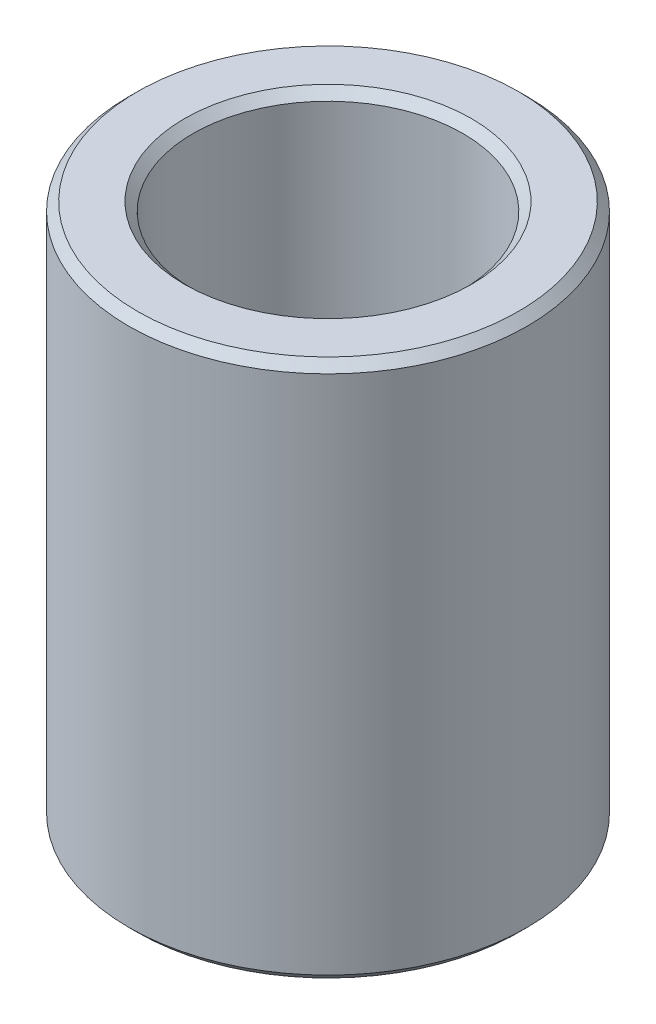
ISO-10303-21;
HEADER;
FILE_DESCRIPTION(('STEP AP214'),'2;1');
FILE_NAME('part.step','',(''),(''),'','','');
FILE_SCHEMA(('AUTOMOTIVE_DESIGN { 1 0 10303 214 1 1 1 1 }'));
ENDSEC;
DATA;
#1=APPLICATION_CONTEXT('core data for automotive mechanical design processes');
#2=APPLICATION_PROTOCOL_DEFINITION('international standard','automotive_design',2000,#1);
#3=PRODUCT_CONTEXT('',#1,'mechanical');
#4=PRODUCT('Part','Part','',(#3));
#5=PRODUCT_RELATED_PRODUCT_CATEGORY('part','',(#4));
#6=PRODUCT_DEFINITION_FORMATION('','',#4);
#7=PRODUCT_DEFINITION_CONTEXT('part definition',#1,'design');
#8=PRODUCT_DEFINITION('design','',#6,#7);
#9=PRODUCT_DEFINITION_SHAPE('','',#8);
#10=(LENGTH_UNIT() NAMED_UNIT(*) SI_UNIT(.MILLI.,.METRE.));
#11=(NAMED_UNIT(*) PLANE_ANGLE_UNIT() SI_UNIT($,.RADIAN.));
#12=(NAMED_UNIT(*) SI_UNIT($,.STERADIAN.) SOLID_ANGLE_UNIT());
#13=UNCERTAINTY_MEASURE_WITH_UNIT(LENGTH_MEASURE(1.E-05),#10,'distance_accuracy_value','');
#14=(GEOMETRIC_REPRESENTATION_CONTEXT(3) GLOBAL_UNCERTAINTY_ASSIGNED_CONTEXT((#13)) GLOBAL_UNIT_ASSIGNED_CONTEXT((#10,
#11,#12)) REPRESENTATION_CONTEXT('',''));
#15=CARTESIAN_POINT('',(0.,0.,0.));
#16=DIRECTION('',(0.,0.,1.));
#17=DIRECTION('',(1.,0.,0.));
#18=AXIS2_PLACEMENT_3D('',#15,#16,#17);
#19=CARTESIAN_POINT('',(0.,162.129846578143,0.));
#20=DIRECTION('',(0.,-1.,0.));
#21=DIRECTION('',(0.,0.,-1.));
#22=AXIS2_PLACEMENT_3D('',#19,#20,#21);
#23=CYLINDRICAL_SURFACE('',#22,60.);
#24=CARTESIAN_POINT('',(0.,2.5911518404744,0.));
#25=DIRECTION('',(0.,1.,0.));
#26=DIRECTION('',(0.,0.,1.));
#27=AXIS2_PLACEMENT_3D('',#24,#25,#26);
#28=CIRCLE('',#27,60.);
#29=CARTESIAN_POINT('',(0.,2.5911518404744,60.));
#30=VERTEX_POINT('',#29);
#31=EDGE_CURVE('E10',#30,#30,#28,.T.);
#32=ORIENTED_EDGE('',*,*,#31,.T.);
#33=EDGE_LOOP('',(#32));
#34=FACE_BOUND('',#33,.T.);
#35=CARTESIAN_POINT('',(0.,159.538694737668,0.));
#36=DIRECTION('',(0.,1.,0.));
#37=DIRECTION('',(0.,0.,1.));
#38=AXIS2_PLACEMENT_3D('',#35,#36,#37);
#39=CIRCLE('',#38,60.);
#40=CARTESIAN_POINT('',(0.,159.538694737668,60.));
#41=VERTEX_POINT('',#40);
#42=EDGE_CURVE('E50',#41,#41,#39,.F.);
#43=ORIENTED_EDGE('',*,*,#42,.T.);
#44=EDGE_LOOP('',(#43));
#45=FACE_BOUND('',#44,.T.);
#46=ADVANCED_FACE('F39',(#34,#45),#23,.T.);
#47=CARTESIAN_POINT('',(0.,162.129846578143,0.));
#48=DIRECTION('',(0.,1.,0.));
#49=DIRECTION('',(0.,0.,1.));
#50=AXIS2_PLACEMENT_3D('',#47,#48,#49);
#51=PLANE('',#50);
#52=CARTESIAN_POINT('',(0.,162.129846578143,0.));
#53=DIRECTION('',(0.,1.,0.));
#54=DIRECTION('',(0.,0.,1.));
#55=AXIS2_PLACEMENT_3D('',#52,#53,#54);
#56=CIRCLE('',#55,43.2731177793423);
#57=CARTESIAN_POINT('',(0.,162.129846578143,43.2731177793423));
#58=VERTEX_POINT('',#57);
#59=EDGE_CURVE('E58',#58,#58,#56,.F.);
#60=ORIENTED_EDGE('',*,*,#59,.T.);
#61=EDGE_LOOP('',(#60));
#62=FACE_BOUND('',#61,.T.);
#63=CARTESIAN_POINT('',(0.,162.129846578143,0.));
#64=DIRECTION('',(0.,1.,0.));
#65=DIRECTION('',(0.,0.,1.));
#66=AXIS2_PLACEMENT_3D('',#63,#64,#65);
#67=CIRCLE('',#66,57.4088481595257);
#68=CARTESIAN_POINT('',(0.,162.129846578143,57.4088481595257));
#69=VERTEX_POINT('',#68);
#70=EDGE_CURVE('E61',#69,#69,#67,.T.);
#71=ORIENTED_EDGE('',*,*,#70,.T.);
#72=EDGE_LOOP('',(#71));
#73=FACE_BOUND('',#72,.T.);
#74=ADVANCED_FACE('F88',(#62,#73),#51,.T.);
#75=CARTESIAN_POINT('',(0.,0.,0.));
#76=DIRECTION('',(0.,1.,0.));
#77=DIRECTION('',(0.,0.,1.));
#78=AXIS2_PLACEMENT_3D('',#75,#76,#77);
#79=PLANE('',#78);
#80=CARTESIAN_POINT('',(0.,0.,0.));
#81=DIRECTION('',(0.,1.,0.));
#82=DIRECTION('',(0.,0.,1.));
#83=AXIS2_PLACEMENT_3D('',#80,#81,#82);
#84=CIRCLE('',#83,43.2731177793423);
#85=CARTESIAN_POINT('',(0.,0.,43.2731177793423));
#86=VERTEX_POINT('',#85);
#87=EDGE_CURVE('E51',#86,#86,#84,.T.);
#88=ORIENTED_EDGE('',*,*,#87,.T.);
#89=EDGE_LOOP('',(#88));
#90=FACE_BOUND('',#89,.T.);
#91=CARTESIAN_POINT('',(0.,0.,0.));
#92=DIRECTION('',(0.,1.,0.));
#93=DIRECTION('',(0.,0.,1.));
#94=AXIS2_PLACEMENT_3D('',#91,#92,#93);
#95=CIRCLE('',#94,57.4088481595256);
#96=CARTESIAN_POINT('',(0.,0.,57.4088481595256));
#97=VERTEX_POINT('',#96);
#98=EDGE_CURVE('E54',#97,#97,#95,.F.);
#99=ORIENTED_EDGE('',*,*,#98,.T.);
#100=EDGE_LOOP('',(#99));
#101=FACE_BOUND('',#100,.T.);
#102=ADVANCED_FACE('F83',(#90,#101),#79,.F.);
#103=CARTESIAN_POINT('',(0.,162.129846578143,0.));
#104=DIRECTION('',(0.,-1.,0.));
#105=DIRECTION('',(0.,0.,-1.));
#106=AXIS2_PLACEMENT_3D('',#103,#104,#105);
#107=CYLINDRICAL_SURFACE('',#106,40.681965938868);
#108=CARTESIAN_POINT('',(0.,159.538694737668,0.));
#109=DIRECTION('',(0.,1.,0.));
#110=DIRECTION('',(0.,0.,1.));
#111=AXIS2_PLACEMENT_3D('',#108,#109,#110);
#112=CIRCLE('',#111,40.681965938868);
#113=CARTESIAN_POINT('',(0.,159.538694737668,40.681965938868));
#114=VERTEX_POINT('',#113);
#115=EDGE_CURVE('E67',#114,#114,#112,.T.);
#116=ORIENTED_EDGE('',*,*,#115,.T.);
#117=EDGE_LOOP('',(#116));
#118=FACE_BOUND('',#117,.T.);
#119=CARTESIAN_POINT('',(0.,2.59115184047434,0.));
#120=DIRECTION('',(0.,1.,0.));
#121=DIRECTION('',(0.,0.,1.));
#122=AXIS2_PLACEMENT_3D('',#119,#120,#121);
#123=CIRCLE('',#122,40.681965938868);
#124=CARTESIAN_POINT('',(0.,2.59115184047434,40.681965938868));
#125=VERTEX_POINT('',#124);
#126=EDGE_CURVE('E69',#125,#125,#123,.F.);
#127=ORIENTED_EDGE('',*,*,#126,.T.);
#128=EDGE_LOOP('',(#127));
#129=FACE_BOUND('',#128,.T.);
#130=ADVANCED_FACE('F71',(#118,#129),#107,.F.);
#131=CARTESIAN_POINT('',(0.,159.538694737668,0.));
#132=DIRECTION('',(0.,1.,0.));
#133=DIRECTION('',(0.,0.,1.));
#134=AXIS2_PLACEMENT_3D('',#131,#132,#133);
#135=CONICAL_SURFACE('',#134,40.681965938868,0.785398163397447);
#136=ORIENTED_EDGE('',*,*,#59,.F.);
#137=EDGE_LOOP('',(#136));
#138=FACE_BOUND('',#137,.T.);
#139=ORIENTED_EDGE('',*,*,#115,.F.);
#140=EDGE_LOOP('',(#139));
#141=FACE_BOUND('',#140,.T.);
#142=ADVANCED_FACE('F77',(#138,#141),#135,.F.);
#143=CARTESIAN_POINT('',(0.,0.,0.));
#144=DIRECTION('',(0.,-1.,0.));
#145=DIRECTION('',(0.,0.,-1.));
#146=AXIS2_PLACEMENT_3D('',#143,#144,#145);
#147=CONICAL_SURFACE('',#146,43.2731177793423,0.785398163397442);
#148=ORIENTED_EDGE('',*,*,#126,.F.);
#149=EDGE_LOOP('',(#148));
#150=FACE_BOUND('',#149,.T.);
#151=ORIENTED_EDGE('',*,*,#87,.F.);
#152=EDGE_LOOP('',(#151));
#153=FACE_BOUND('',#152,.T.);
#154=ADVANCED_FACE('F73',(#150,#153),#147,.F.);
#155=CARTESIAN_POINT('',(0.,2.5911518404744,0.));
#156=DIRECTION('',(0.,1.,0.));
#157=DIRECTION('',(0.,0.,1.));
#158=AXIS2_PLACEMENT_3D('',#155,#156,#157);
#159=CONICAL_SURFACE('',#158,60.,0.785398163397451);
#160=ORIENTED_EDGE('',*,*,#98,.F.);
#161=EDGE_LOOP('',(#160));
#162=FACE_BOUND('',#161,.T.);
#163=ORIENTED_EDGE('',*,*,#31,.F.);
#164=EDGE_LOOP('',(#163));
#165=FACE_BOUND('',#164,.T.);
#166=ADVANCED_FACE('F76',(#162,#165),#159,.T.);
#167=CARTESIAN_POINT('',(0.,162.129846578143,0.));
#168=DIRECTION('',(0.,-1.,0.));
#169=DIRECTION('',(0.,0.,-1.));
#170=AXIS2_PLACEMENT_3D('',#167,#168,#169);
#171=CONICAL_SURFACE('',#170,57.4088481595257,0.785398163397443);
#172=ORIENTED_EDGE('',*,*,#42,.F.);
#173=EDGE_LOOP('',(#172));
#174=FACE_BOUND('',#173,.T.);
#175=ORIENTED_EDGE('',*,*,#70,.F.);
#176=EDGE_LOOP('',(#175));
#177=FACE_BOUND('',#176,.T.);
#178=ADVANCED_FACE('F45',(#174,#177),#171,.T.);
#179=CLOSED_SHELL('',(#46,#74,#102,#130,#142,#154,#166,#178));
#180=MANIFOLD_SOLID_BREP('B2',#179);
#181=ADVANCED_BREP_SHAPE_REPRESENTATION('',(#18,#180),#14);
#182=SHAPE_DEFINITION_REPRESENTATION(#9,#181);
ENDSEC;
END-ISO-10303-21;
